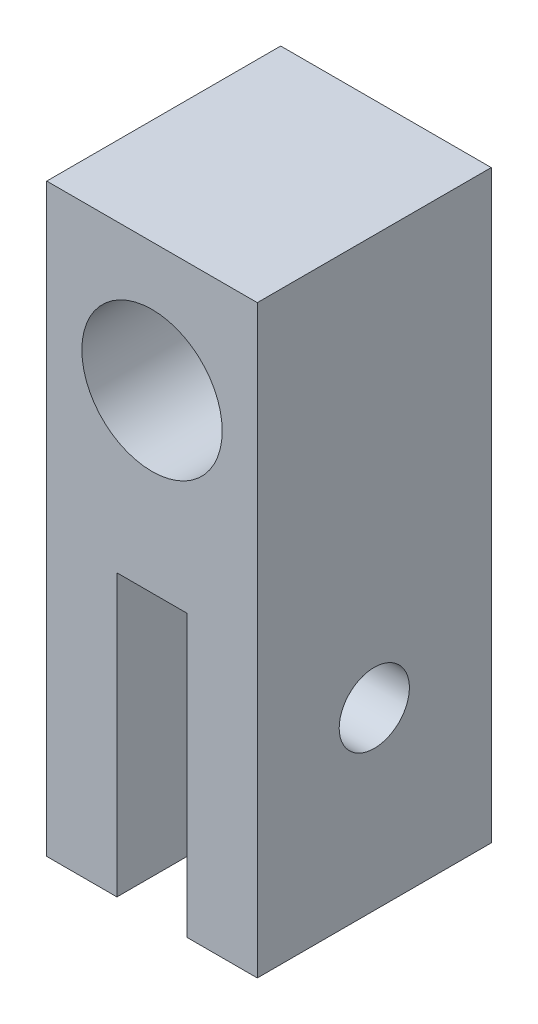
ISO-10303-21;
HEADER;
FILE_DESCRIPTION(('STEP AP214'),'2;1');
FILE_NAME('part.step','',(''),(''),'','','');
FILE_SCHEMA(('AUTOMOTIVE_DESIGN { 1 0 10303 214 1 1 1 1 }'));
ENDSEC;
DATA;
#1=APPLICATION_CONTEXT('core data for automotive mechanical design processes');
#2=APPLICATION_PROTOCOL_DEFINITION('international standard','automotive_design',2000,#1);
#3=PRODUCT_CONTEXT('',#1,'mechanical');
#4=PRODUCT('Part','Part','',(#3));
#5=PRODUCT_RELATED_PRODUCT_CATEGORY('part','',(#4));
#6=PRODUCT_DEFINITION_FORMATION('','',#4);
#7=PRODUCT_DEFINITION_CONTEXT('part definition',#1,'design');
#8=PRODUCT_DEFINITION('design','',#6,#7);
#9=PRODUCT_DEFINITION_SHAPE('','',#8);
#10=(LENGTH_UNIT() NAMED_UNIT(*) SI_UNIT(.MILLI.,.METRE.));
#11=(NAMED_UNIT(*) PLANE_ANGLE_UNIT() SI_UNIT($,.RADIAN.));
#12=(NAMED_UNIT(*) SI_UNIT($,.STERADIAN.) SOLID_ANGLE_UNIT());
#13=UNCERTAINTY_MEASURE_WITH_UNIT(LENGTH_MEASURE(1.E-05),#10,'distance_accuracy_value','');
#14=(GEOMETRIC_REPRESENTATION_CONTEXT(3) GLOBAL_UNCERTAINTY_ASSIGNED_CONTEXT((#13)) GLOBAL_UNIT_ASSIGNED_CONTEXT((#10,
#11,#12)) REPRESENTATION_CONTEXT('',''));
#15=CARTESIAN_POINT('',(0.,0.,0.));
#16=DIRECTION('',(0.,0.,1.));
#17=DIRECTION('',(1.,0.,0.));
#18=AXIS2_PLACEMENT_3D('',#15,#16,#17);
#19=CARTESIAN_POINT('',(-1.5,0.,10.));
#20=DIRECTION('',(-1.,0.,0.));
#21=DIRECTION('',(0.,0.,1.));
#22=AXIS2_PLACEMENT_3D('',#19,#20,#21);
#23=PLANE('',#22);
#24=CARTESIAN_POINT('',(-1.5,-5.,5.));
#25=DIRECTION('',(-1.,0.,0.));
#26=DIRECTION('',(0.,0.,1.));
#27=AXIS2_PLACEMENT_3D('',#24,#25,#26);
#28=CIRCLE('',#27,1.5);
#29=CARTESIAN_POINT('',(-1.5,-5.,6.5));
#30=VERTEX_POINT('',#29);
#31=EDGE_CURVE('E134',#30,#30,#28,.T.);
#32=ORIENTED_EDGE('',*,*,#31,.T.);
#33=EDGE_LOOP('',(#32));
#34=FACE_BOUND('',#33,.T.);
#35=DIRECTION('',(0.,1.,0.));
#36=VECTOR('',#35,1.);
#37=CARTESIAN_POINT('',(-1.5,0.,0.));
#38=LINE('',#37,#36);
#39=CARTESIAN_POINT('',(-1.5,-12.5,0.));
#40=VERTEX_POINT('',#39);
#41=CARTESIAN_POINT('',(-1.5,-0.5,0.));
#42=VERTEX_POINT('',#41);
#43=EDGE_CURVE('E133',#40,#42,#38,.T.);
#44=ORIENTED_EDGE('',*,*,#43,.T.);
#45=DIRECTION('',(0.,0.,-1.));
#46=VECTOR('',#45,1.);
#47=CARTESIAN_POINT('',(-1.5,-0.5,10.));
#48=LINE('',#47,#46);
#49=CARTESIAN_POINT('',(-1.5,-0.5,10.));
#50=VERTEX_POINT('',#49);
#51=EDGE_CURVE('E11',#50,#42,#48,.T.);
#52=ORIENTED_EDGE('',*,*,#51,.F.);
#53=DIRECTION('',(0.,1.,0.));
#54=VECTOR('',#53,1.);
#55=CARTESIAN_POINT('',(-1.5,0.,10.));
#56=LINE('',#55,#54);
#57=CARTESIAN_POINT('',(-1.5,-12.5,10.));
#58=VERTEX_POINT('',#57);
#59=EDGE_CURVE('E180',#58,#50,#56,.T.);
#60=ORIENTED_EDGE('',*,*,#59,.F.);
#61=DIRECTION('',(0.,0.,-1.));
#62=VECTOR('',#61,1.);
#63=CARTESIAN_POINT('',(-1.5,-12.5,10.));
#64=LINE('',#63,#62);
#65=EDGE_CURVE('E125',#58,#40,#64,.T.);
#66=ORIENTED_EDGE('',*,*,#65,.T.);
#67=EDGE_LOOP('',(#44,#52,#60,#66));
#68=FACE_BOUND('',#67,.T.);
#69=ADVANCED_FACE('F34',(#34,#68),#23,.F.);
#70=CARTESIAN_POINT('',(0.,-0.5,10.));
#71=DIRECTION('',(0.,1.,0.));
#72=DIRECTION('',(0.,0.,1.));
#73=AXIS2_PLACEMENT_3D('',#70,#71,#72);
#74=PLANE('',#73);
#75=DIRECTION('',(1.,0.,0.));
#76=VECTOR('',#75,1.);
#77=CARTESIAN_POINT('',(0.,-0.5,0.));
#78=LINE('',#77,#76);
#79=CARTESIAN_POINT('',(1.5,-0.5,0.));
#80=VERTEX_POINT('',#79);
#81=EDGE_CURVE('E137',#42,#80,#78,.T.);
#82=ORIENTED_EDGE('',*,*,#81,.T.);
#83=DIRECTION('',(0.,0.,-1.));
#84=VECTOR('',#83,1.);
#85=CARTESIAN_POINT('',(1.5,-0.5,10.));
#86=LINE('',#85,#84);
#87=CARTESIAN_POINT('',(1.5,-0.5,10.));
#88=VERTEX_POINT('',#87);
#89=EDGE_CURVE('E43',#88,#80,#86,.T.);
#90=ORIENTED_EDGE('',*,*,#89,.F.);
#91=DIRECTION('',(1.,0.,0.));
#92=VECTOR('',#91,1.);
#93=CARTESIAN_POINT('',(0.,-0.5,10.));
#94=LINE('',#93,#92);
#95=EDGE_CURVE('E90',#50,#88,#94,.T.);
#96=ORIENTED_EDGE('',*,*,#95,.F.);
#97=ORIENTED_EDGE('',*,*,#51,.T.);
#98=EDGE_LOOP('',(#82,#90,#96,#97));
#99=FACE_BOUND('',#98,.T.);
#100=ADVANCED_FACE('F164',(#99),#74,.F.);
#101=CARTESIAN_POINT('',(1.5,0.,10.));
#102=DIRECTION('',(-1.,0.,0.));
#103=DIRECTION('',(0.,0.,1.));
#104=AXIS2_PLACEMENT_3D('',#101,#102,#103);
#105=PLANE('',#104);
#106=CARTESIAN_POINT('',(1.5,-5.,5.));
#107=DIRECTION('',(-1.,0.,0.));
#108=DIRECTION('',(0.,0.,1.));
#109=AXIS2_PLACEMENT_3D('',#106,#107,#108);
#110=CIRCLE('',#109,1.5);
#111=CARTESIAN_POINT('',(1.5,-5.,6.5));
#112=VERTEX_POINT('',#111);
#113=EDGE_CURVE('E187',#112,#112,#110,.T.);
#114=ORIENTED_EDGE('',*,*,#113,.F.);
#115=EDGE_LOOP('',(#114));
#116=FACE_BOUND('',#115,.T.);
#117=DIRECTION('',(0.,1.,0.));
#118=VECTOR('',#117,1.);
#119=CARTESIAN_POINT('',(1.5,0.,0.));
#120=LINE('',#119,#118);
#121=CARTESIAN_POINT('',(1.5,-12.5,0.));
#122=VERTEX_POINT('',#121);
#123=EDGE_CURVE('E140',#122,#80,#120,.T.);
#124=ORIENTED_EDGE('',*,*,#123,.F.);
#125=DIRECTION('',(0.,0.,-1.));
#126=VECTOR('',#125,1.);
#127=CARTESIAN_POINT('',(1.5,-12.5,10.));
#128=LINE('',#127,#126);
#129=CARTESIAN_POINT('',(1.5,-12.5,10.));
#130=VERTEX_POINT('',#129);
#131=EDGE_CURVE('E157',#130,#122,#128,.T.);
#132=ORIENTED_EDGE('',*,*,#131,.F.);
#133=DIRECTION('',(0.,1.,0.));
#134=VECTOR('',#133,1.);
#135=CARTESIAN_POINT('',(1.5,0.,10.));
#136=LINE('',#135,#134);
#137=EDGE_CURVE('E163',#130,#88,#136,.T.);
#138=ORIENTED_EDGE('',*,*,#137,.T.);
#139=ORIENTED_EDGE('',*,*,#89,.T.);
#140=EDGE_LOOP('',(#124,#132,#138,#139));
#141=FACE_BOUND('',#140,.T.);
#142=ADVANCED_FACE('F161',(#116,#141),#105,.T.);
#143=CARTESIAN_POINT('',(0.,-12.5,10.));
#144=DIRECTION('',(0.,1.,0.));
#145=DIRECTION('',(0.,0.,1.));
#146=AXIS2_PLACEMENT_3D('',#143,#144,#145);
#147=PLANE('',#146);
#148=DIRECTION('',(1.,0.,0.));
#149=VECTOR('',#148,1.);
#150=CARTESIAN_POINT('',(0.,-12.5,0.));
#151=LINE('',#150,#149);
#152=CARTESIAN_POINT('',(4.5,-12.5,0.));
#153=VERTEX_POINT('',#152);
#154=EDGE_CURVE('E143',#122,#153,#151,.T.);
#155=ORIENTED_EDGE('',*,*,#154,.T.);
#156=DIRECTION('',(0.,0.,-1.));
#157=VECTOR('',#156,1.);
#158=CARTESIAN_POINT('',(4.5,-12.5,10.));
#159=LINE('',#158,#157);
#160=CARTESIAN_POINT('',(4.5,-12.5,10.));
#161=VERTEX_POINT('',#160);
#162=EDGE_CURVE('E154',#161,#153,#159,.T.);
#163=ORIENTED_EDGE('',*,*,#162,.F.);
#164=DIRECTION('',(1.,0.,0.));
#165=VECTOR('',#164,1.);
#166=CARTESIAN_POINT('',(0.,-12.5,10.));
#167=LINE('',#166,#165);
#168=EDGE_CURVE('E127',#130,#161,#167,.T.);
#169=ORIENTED_EDGE('',*,*,#168,.F.);
#170=ORIENTED_EDGE('',*,*,#131,.T.);
#171=EDGE_LOOP('',(#155,#163,#169,#170));
#172=FACE_BOUND('',#171,.T.);
#173=ADVANCED_FACE('F173',(#172),#147,.F.);
#174=CARTESIAN_POINT('',(4.5,0.,10.));
#175=DIRECTION('',(-1.,0.,0.));
#176=DIRECTION('',(0.,0.,1.));
#177=AXIS2_PLACEMENT_3D('',#174,#175,#176);
#178=PLANE('',#177);
#179=CARTESIAN_POINT('',(4.5,-5.,5.));
#180=DIRECTION('',(-1.,0.,0.));
#181=DIRECTION('',(0.,0.,1.));
#182=AXIS2_PLACEMENT_3D('',#179,#180,#181);
#183=CIRCLE('',#182,1.5);
#184=CARTESIAN_POINT('',(4.5,-5.,6.5));
#185=VERTEX_POINT('',#184);
#186=EDGE_CURVE('E190',#185,#185,#183,.T.);
#187=ORIENTED_EDGE('',*,*,#186,.T.);
#188=EDGE_LOOP('',(#187));
#189=FACE_BOUND('',#188,.T.);
#190=DIRECTION('',(0.,1.,0.));
#191=VECTOR('',#190,1.);
#192=CARTESIAN_POINT('',(4.5,0.,0.));
#193=LINE('',#192,#191);
#194=CARTESIAN_POINT('',(4.5,12.5,0.));
#195=VERTEX_POINT('',#194);
#196=EDGE_CURVE('E145',#153,#195,#193,.T.);
#197=ORIENTED_EDGE('',*,*,#196,.T.);
#198=DIRECTION('',(0.,0.,-1.));
#199=VECTOR('',#198,1.);
#200=CARTESIAN_POINT('',(4.5,12.5,10.));
#201=LINE('',#200,#199);
#202=CARTESIAN_POINT('',(4.5,12.5,10.));
#203=VERTEX_POINT('',#202);
#204=EDGE_CURVE('E115',#203,#195,#201,.T.);
#205=ORIENTED_EDGE('',*,*,#204,.F.);
#206=DIRECTION('',(0.,1.,0.));
#207=VECTOR('',#206,1.);
#208=CARTESIAN_POINT('',(4.5,0.,10.));
#209=LINE('',#208,#207);
#210=EDGE_CURVE('E120',#161,#203,#209,.T.);
#211=ORIENTED_EDGE('',*,*,#210,.F.);
#212=ORIENTED_EDGE('',*,*,#162,.T.);
#213=EDGE_LOOP('',(#197,#205,#211,#212));
#214=FACE_BOUND('',#213,.T.);
#215=ADVANCED_FACE('F176',(#189,#214),#178,.F.);
#216=CARTESIAN_POINT('',(0.,12.5,10.));
#217=DIRECTION('',(0.,1.,0.));
#218=DIRECTION('',(0.,0.,1.));
#219=AXIS2_PLACEMENT_3D('',#216,#217,#218);
#220=PLANE('',#219);
#221=DIRECTION('',(1.,0.,0.));
#222=VECTOR('',#221,1.);
#223=CARTESIAN_POINT('',(0.,12.5,0.));
#224=LINE('',#223,#222);
#225=CARTESIAN_POINT('',(-4.5,12.5,0.));
#226=VERTEX_POINT('',#225);
#227=EDGE_CURVE('E110',#226,#195,#224,.T.);
#228=ORIENTED_EDGE('',*,*,#227,.F.);
#229=DIRECTION('',(0.,0.,-1.));
#230=VECTOR('',#229,1.);
#231=CARTESIAN_POINT('',(-4.5,12.5,10.));
#232=LINE('',#231,#230);
#233=CARTESIAN_POINT('',(-4.5,12.5,10.));
#234=VERTEX_POINT('',#233);
#235=EDGE_CURVE('E105',#234,#226,#232,.T.);
#236=ORIENTED_EDGE('',*,*,#235,.F.);
#237=DIRECTION('',(1.,0.,0.));
#238=VECTOR('',#237,1.);
#239=CARTESIAN_POINT('',(0.,12.5,10.));
#240=LINE('',#239,#238);
#241=EDGE_CURVE('E108',#234,#203,#240,.T.);
#242=ORIENTED_EDGE('',*,*,#241,.T.);
#243=ORIENTED_EDGE('',*,*,#204,.T.);
#244=EDGE_LOOP('',(#228,#236,#242,#243));
#245=FACE_BOUND('',#244,.T.);
#246=ADVANCED_FACE('F107',(#245),#220,.T.);
#247=CARTESIAN_POINT('',(-4.5,0.,10.));
#248=DIRECTION('',(-1.,0.,0.));
#249=DIRECTION('',(0.,0.,1.));
#250=AXIS2_PLACEMENT_3D('',#247,#248,#249);
#251=PLANE('',#250);
#252=CARTESIAN_POINT('',(-4.5,-5.,5.));
#253=DIRECTION('',(1.,0.,0.));
#254=DIRECTION('',(0.,0.,-1.));
#255=AXIS2_PLACEMENT_3D('',#252,#253,#254);
#256=CIRCLE('',#255,1.5);
#257=CARTESIAN_POINT('',(-4.5,-5.,3.5));
#258=VERTEX_POINT('',#257);
#259=EDGE_CURVE('E193',#258,#258,#256,.T.);
#260=ORIENTED_EDGE('',*,*,#259,.T.);
#261=EDGE_LOOP('',(#260));
#262=FACE_BOUND('',#261,.T.);
#263=DIRECTION('',(0.,1.,0.));
#264=VECTOR('',#263,1.);
#265=CARTESIAN_POINT('',(-4.5,0.,0.));
#266=LINE('',#265,#264);
#267=CARTESIAN_POINT('',(-4.5,-12.5,0.));
#268=VERTEX_POINT('',#267);
#269=EDGE_CURVE('E149',#268,#226,#266,.T.);
#270=ORIENTED_EDGE('',*,*,#269,.F.);
#271=DIRECTION('',(0.,0.,-1.));
#272=VECTOR('',#271,1.);
#273=CARTESIAN_POINT('',(-4.5,-12.5,10.));
#274=LINE('',#273,#272);
#275=CARTESIAN_POINT('',(-4.5,-12.5,10.));
#276=VERTEX_POINT('',#275);
#277=EDGE_CURVE('E79',#276,#268,#274,.T.);
#278=ORIENTED_EDGE('',*,*,#277,.F.);
#279=DIRECTION('',(0.,1.,0.));
#280=VECTOR('',#279,1.);
#281=CARTESIAN_POINT('',(-4.5,0.,10.));
#282=LINE('',#281,#280);
#283=EDGE_CURVE('E118',#276,#234,#282,.T.);
#284=ORIENTED_EDGE('',*,*,#283,.T.);
#285=ORIENTED_EDGE('',*,*,#235,.T.);
#286=EDGE_LOOP('',(#270,#278,#284,#285));
#287=FACE_BOUND('',#286,.T.);
#288=ADVANCED_FACE('F123',(#262,#287),#251,.T.);
#289=CARTESIAN_POINT('',(0.,7.,10.));
#290=DIRECTION('',(0.,0.,-1.));
#291=DIRECTION('',(-1.,0.,0.));
#292=AXIS2_PLACEMENT_3D('',#289,#290,#291);
#293=CYLINDRICAL_SURFACE('',#292,3.);
#294=CARTESIAN_POINT('',(0.,7.,10.));
#295=DIRECTION('',(0.,0.,1.));
#296=DIRECTION('',(1.,0.,0.));
#297=AXIS2_PLACEMENT_3D('',#294,#295,#296);
#298=CIRCLE('',#297,3.);
#299=CARTESIAN_POINT('',(3.,7.,10.));
#300=VERTEX_POINT('',#299);
#301=EDGE_CURVE('E182',#300,#300,#298,.T.);
#302=ORIENTED_EDGE('',*,*,#301,.T.);
#303=EDGE_LOOP('',(#302));
#304=FACE_BOUND('',#303,.T.);
#305=CARTESIAN_POINT('',(0.,7.,0.));
#306=DIRECTION('',(0.,0.,1.));
#307=DIRECTION('',(1.,0.,0.));
#308=AXIS2_PLACEMENT_3D('',#305,#306,#307);
#309=CIRCLE('',#308,3.);
#310=CARTESIAN_POINT('',(3.,7.,0.));
#311=VERTEX_POINT('',#310);
#312=EDGE_CURVE('E130',#311,#311,#309,.T.);
#313=ORIENTED_EDGE('',*,*,#312,.F.);
#314=EDGE_LOOP('',(#313));
#315=FACE_BOUND('',#314,.T.);
#316=ADVANCED_FACE('F36',(#304,#315),#293,.F.);
#317=EDGE_CURVE('E82',#268,#40,#151,.T.);
#318=ORIENTED_EDGE('',*,*,#317,.T.);
#319=ORIENTED_EDGE('',*,*,#65,.F.);
#320=EDGE_CURVE('E51',#276,#58,#167,.T.);
#321=ORIENTED_EDGE('',*,*,#320,.F.);
#322=ORIENTED_EDGE('',*,*,#277,.T.);
#323=EDGE_LOOP('',(#318,#319,#321,#322));
#324=FACE_BOUND('',#323,.T.);
#325=ADVANCED_FACE('F208',(#324),#147,.F.);
#326=CARTESIAN_POINT('',(0.,0.,10.));
#327=DIRECTION('',(0.,0.,1.));
#328=DIRECTION('',(1.,0.,0.));
#329=AXIS2_PLACEMENT_3D('',#326,#327,#328);
#330=PLANE('',#329);
#331=ORIENTED_EDGE('',*,*,#301,.F.);
#332=EDGE_LOOP('',(#331));
#333=FACE_BOUND('',#332,.T.);
#334=ORIENTED_EDGE('',*,*,#59,.T.);
#335=ORIENTED_EDGE('',*,*,#95,.T.);
#336=ORIENTED_EDGE('',*,*,#137,.F.);
#337=ORIENTED_EDGE('',*,*,#168,.T.);
#338=ORIENTED_EDGE('',*,*,#210,.T.);
#339=ORIENTED_EDGE('',*,*,#241,.F.);
#340=ORIENTED_EDGE('',*,*,#283,.F.);
#341=ORIENTED_EDGE('',*,*,#320,.T.);
#342=EDGE_LOOP('',(#334,#335,#336,#337,#338,#339,#340,#341));
#343=FACE_BOUND('',#342,.T.);
#344=ADVANCED_FACE('F117',(#333,#343),#330,.T.);
#345=CARTESIAN_POINT('',(0.,0.,0.));
#346=DIRECTION('',(0.,0.,1.));
#347=DIRECTION('',(1.,0.,0.));
#348=AXIS2_PLACEMENT_3D('',#345,#346,#347);
#349=PLANE('',#348);
#350=ORIENTED_EDGE('',*,*,#312,.T.);
#351=EDGE_LOOP('',(#350));
#352=FACE_BOUND('',#351,.T.);
#353=ORIENTED_EDGE('',*,*,#43,.F.);
#354=ORIENTED_EDGE('',*,*,#317,.F.);
#355=ORIENTED_EDGE('',*,*,#269,.T.);
#356=ORIENTED_EDGE('',*,*,#227,.T.);
#357=ORIENTED_EDGE('',*,*,#196,.F.);
#358=ORIENTED_EDGE('',*,*,#154,.F.);
#359=ORIENTED_EDGE('',*,*,#123,.T.);
#360=ORIENTED_EDGE('',*,*,#81,.F.);
#361=EDGE_LOOP('',(#353,#354,#355,#356,#357,#358,#359,#360));
#362=FACE_BOUND('',#361,.T.);
#363=ADVANCED_FACE('F169',(#352,#362),#349,.F.);
#364=CARTESIAN_POINT('',(-4.5,-5.,5.));
#365=DIRECTION('',(1.,0.,0.));
#366=DIRECTION('',(0.,0.,-1.));
#367=AXIS2_PLACEMENT_3D('',#364,#365,#366);
#368=CYLINDRICAL_SURFACE('',#367,1.5);
#369=ORIENTED_EDGE('',*,*,#259,.F.);
#370=EDGE_LOOP('',(#369));
#371=FACE_BOUND('',#370,.T.);
#372=ORIENTED_EDGE('',*,*,#31,.F.);
#373=EDGE_LOOP('',(#372));
#374=FACE_BOUND('',#373,.T.);
#375=ADVANCED_FACE('F198',(#371,#374),#368,.F.);
#376=ORIENTED_EDGE('',*,*,#113,.T.);
#377=EDGE_LOOP('',(#376));
#378=FACE_BOUND('',#377,.T.);
#379=ORIENTED_EDGE('',*,*,#186,.F.);
#380=EDGE_LOOP('',(#379));
#381=FACE_BOUND('',#380,.T.);
#382=ADVANCED_FACE('F201',(#378,#381),#368,.F.);
#383=CLOSED_SHELL('',(#69,#100,#142,#173,#215,#246,#288,#316,#325,#344,#363,#375,#382));
#384=MANIFOLD_SOLID_BREP('B2',#383);
#385=ADVANCED_BREP_SHAPE_REPRESENTATION('',(#18,#384),#14);
#386=SHAPE_DEFINITION_REPRESENTATION(#9,#385);
ENDSEC;
END-ISO-10303-21;
